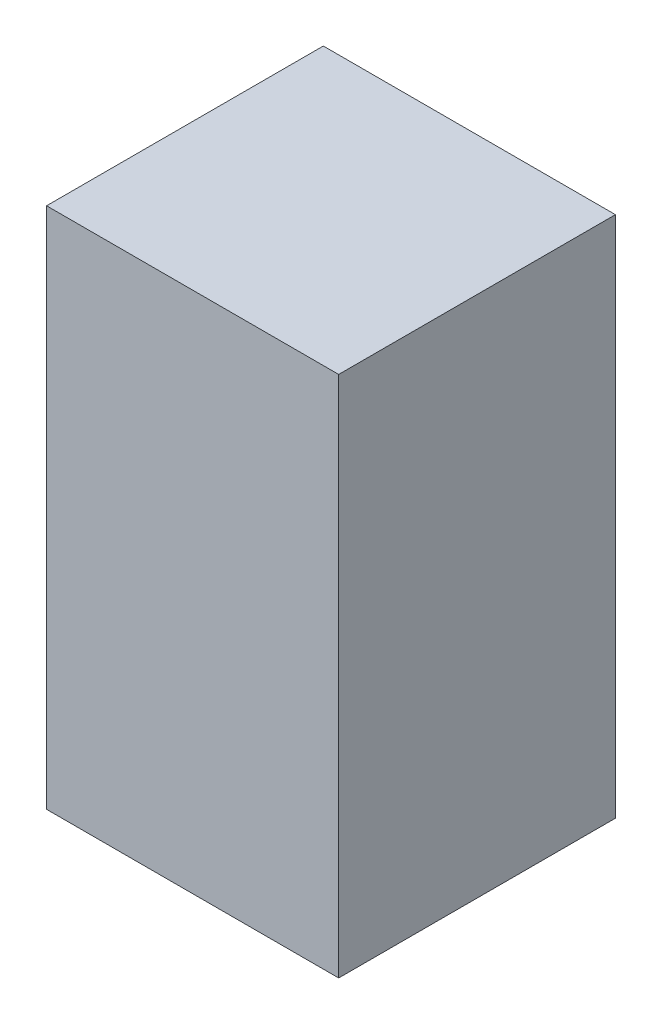
ISO-10303-21;
HEADER;
FILE_DESCRIPTION(('STEP AP214'),'2;1');
FILE_NAME('part.step','',(''),(''),'','','');
FILE_SCHEMA(('AUTOMOTIVE_DESIGN { 1 0 10303 214 1 1 1 1 }'));
ENDSEC;
DATA;
#1=APPLICATION_CONTEXT('core data for automotive mechanical design processes');
#2=APPLICATION_PROTOCOL_DEFINITION('international standard','automotive_design',2000,#1);
#3=PRODUCT_CONTEXT('',#1,'mechanical');
#4=PRODUCT('Part','Part','',(#3));
#5=PRODUCT_RELATED_PRODUCT_CATEGORY('part','',(#4));
#6=PRODUCT_DEFINITION_FORMATION('','',#4);
#7=PRODUCT_DEFINITION_CONTEXT('part definition',#1,'design');
#8=PRODUCT_DEFINITION('design','',#6,#7);
#9=PRODUCT_DEFINITION_SHAPE('','',#8);
#10=(LENGTH_UNIT() NAMED_UNIT(*) SI_UNIT(.MILLI.,.METRE.));
#11=(NAMED_UNIT(*) PLANE_ANGLE_UNIT() SI_UNIT($,.RADIAN.));
#12=(NAMED_UNIT(*) SI_UNIT($,.STERADIAN.) SOLID_ANGLE_UNIT());
#13=UNCERTAINTY_MEASURE_WITH_UNIT(LENGTH_MEASURE(1.E-05),#10,'distance_accuracy_value','');
#14=(GEOMETRIC_REPRESENTATION_CONTEXT(3) GLOBAL_UNCERTAINTY_ASSIGNED_CONTEXT((#13)) GLOBAL_UNIT_ASSIGNED_CONTEXT((#10,
#11,#12)) REPRESENTATION_CONTEXT('',''));
#15=CARTESIAN_POINT('',(0.,0.,0.));
#16=DIRECTION('',(0.,0.,1.));
#17=DIRECTION('',(1.,0.,0.));
#18=AXIS2_PLACEMENT_3D('',#15,#16,#17);
#19=CARTESIAN_POINT('',(0.47500032,0.85000084,0.90000074));
#20=DIRECTION('',(1.,0.,0.));
#21=DIRECTION('',(0.,0.,-1.));
#22=AXIS2_PLACEMENT_3D('',#19,#20,#21);
#23=PLANE('',#22);
#24=DIRECTION('',(0.,-1.,0.));
#25=VECTOR('',#24,1.);
#26=CARTESIAN_POINT('',(0.47500032,0.85000084,0.));
#27=LINE('',#26,#25);
#28=CARTESIAN_POINT('',(0.47500032,0.85000084,0.));
#29=VERTEX_POINT('',#28);
#30=CARTESIAN_POINT('',(0.47500032,-0.85000084,0.));
#31=VERTEX_POINT('',#30);
#32=EDGE_CURVE('E96',#29,#31,#27,.T.);
#33=ORIENTED_EDGE('',*,*,#32,.F.);
#34=DIRECTION('',(0.,0.,-1.));
#35=VECTOR('',#34,1.);
#36=CARTESIAN_POINT('',(0.47500032,0.85000084,0.90000074));
#37=LINE('',#36,#35);
#38=CARTESIAN_POINT('',(0.47500032,0.85000084,0.90000074));
#39=VERTEX_POINT('',#38);
#40=EDGE_CURVE('E11',#39,#29,#37,.T.);
#41=ORIENTED_EDGE('',*,*,#40,.F.);
#42=DIRECTION('',(0.,-1.,0.));
#43=VECTOR('',#42,1.);
#44=CARTESIAN_POINT('',(0.47500032,0.85000084,0.90000074));
#45=LINE('',#44,#43);
#46=CARTESIAN_POINT('',(0.47500032,-0.85000084,0.90000074));
#47=VERTEX_POINT('',#46);
#48=EDGE_CURVE('E90',#39,#47,#45,.T.);
#49=ORIENTED_EDGE('',*,*,#48,.T.);
#50=DIRECTION('',(0.,0.,-1.));
#51=VECTOR('',#50,1.);
#52=CARTESIAN_POINT('',(0.47500032,-0.85000084,0.90000074));
#53=LINE('',#52,#51);
#54=EDGE_CURVE('E35',#47,#31,#53,.T.);
#55=ORIENTED_EDGE('',*,*,#54,.T.);
#56=EDGE_LOOP('',(#33,#41,#49,#55));
#57=FACE_BOUND('',#56,.T.);
#58=ADVANCED_FACE('F32',(#57),#23,.T.);
#59=CARTESIAN_POINT('',(-0.47500032,0.85000084,0.90000074));
#60=DIRECTION('',(0.,1.,0.));
#61=DIRECTION('',(0.,0.,1.));
#62=AXIS2_PLACEMENT_3D('',#59,#60,#61);
#63=PLANE('',#62);
#64=DIRECTION('',(1.,0.,0.));
#65=VECTOR('',#64,1.);
#66=CARTESIAN_POINT('',(-0.47500032,0.85000084,0.));
#67=LINE('',#66,#65);
#68=CARTESIAN_POINT('',(-0.47500032,0.85000084,0.));
#69=VERTEX_POINT('',#68);
#70=EDGE_CURVE('E92',#69,#29,#67,.T.);
#71=ORIENTED_EDGE('',*,*,#70,.F.);
#72=DIRECTION('',(0.,0.,-1.));
#73=VECTOR('',#72,1.);
#74=CARTESIAN_POINT('',(-0.47500032,0.85000084,0.90000074));
#75=LINE('',#74,#73);
#76=CARTESIAN_POINT('',(-0.47500032,0.85000084,0.90000074));
#77=VERTEX_POINT('',#76);
#78=EDGE_CURVE('E41',#77,#69,#75,.T.);
#79=ORIENTED_EDGE('',*,*,#78,.F.);
#80=DIRECTION('',(1.,0.,0.));
#81=VECTOR('',#80,1.);
#82=CARTESIAN_POINT('',(-0.47500032,0.85000084,0.90000074));
#83=LINE('',#82,#81);
#84=EDGE_CURVE('E87',#77,#39,#83,.T.);
#85=ORIENTED_EDGE('',*,*,#84,.T.);
#86=ORIENTED_EDGE('',*,*,#40,.T.);
#87=EDGE_LOOP('',(#71,#79,#85,#86));
#88=FACE_BOUND('',#87,.T.);
#89=ADVANCED_FACE('F106',(#88),#63,.T.);
#90=CARTESIAN_POINT('',(-0.47500032,-0.85000084,0.90000074));
#91=DIRECTION('',(-1.,0.,0.));
#92=DIRECTION('',(0.,0.,1.));
#93=AXIS2_PLACEMENT_3D('',#90,#91,#92);
#94=PLANE('',#93);
#95=DIRECTION('',(0.,1.,0.));
#96=VECTOR('',#95,1.);
#97=CARTESIAN_POINT('',(-0.47500032,-0.85000084,0.));
#98=LINE('',#97,#96);
#99=CARTESIAN_POINT('',(-0.47500032,-0.85000084,0.));
#100=VERTEX_POINT('',#99);
#101=EDGE_CURVE('E82',#100,#69,#98,.T.);
#102=ORIENTED_EDGE('',*,*,#101,.F.);
#103=DIRECTION('',(0.,0.,-1.));
#104=VECTOR('',#103,1.);
#105=CARTESIAN_POINT('',(-0.47500032,-0.85000084,0.90000074));
#106=LINE('',#105,#104);
#107=CARTESIAN_POINT('',(-0.47500032,-0.85000084,0.90000074));
#108=VERTEX_POINT('',#107);
#109=EDGE_CURVE('E77',#108,#100,#106,.T.);
#110=ORIENTED_EDGE('',*,*,#109,.F.);
#111=DIRECTION('',(0.,1.,0.));
#112=VECTOR('',#111,1.);
#113=CARTESIAN_POINT('',(-0.47500032,-0.85000084,0.90000074));
#114=LINE('',#113,#112);
#115=EDGE_CURVE('E80',#108,#77,#114,.T.);
#116=ORIENTED_EDGE('',*,*,#115,.T.);
#117=ORIENTED_EDGE('',*,*,#78,.T.);
#118=EDGE_LOOP('',(#102,#110,#116,#117));
#119=FACE_BOUND('',#118,.T.);
#120=ADVANCED_FACE('F79',(#119),#94,.T.);
#121=CARTESIAN_POINT('',(0.47500032,-0.85000084,0.90000074));
#122=DIRECTION('',(0.,-1.,0.));
#123=DIRECTION('',(0.,0.,-1.));
#124=AXIS2_PLACEMENT_3D('',#121,#122,#123);
#125=PLANE('',#124);
#126=DIRECTION('',(-1.,0.,0.));
#127=VECTOR('',#126,1.);
#128=CARTESIAN_POINT('',(0.47500032,-0.85000084,0.));
#129=LINE('',#128,#127);
#130=EDGE_CURVE('E99',#31,#100,#129,.T.);
#131=ORIENTED_EDGE('',*,*,#130,.F.);
#132=ORIENTED_EDGE('',*,*,#54,.F.);
#133=DIRECTION('',(-1.,0.,0.));
#134=VECTOR('',#133,1.);
#135=CARTESIAN_POINT('',(0.47500032,-0.85000084,0.90000074));
#136=LINE('',#135,#134);
#137=EDGE_CURVE('E86',#47,#108,#136,.T.);
#138=ORIENTED_EDGE('',*,*,#137,.T.);
#139=ORIENTED_EDGE('',*,*,#109,.T.);
#140=EDGE_LOOP('',(#131,#132,#138,#139));
#141=FACE_BOUND('',#140,.T.);
#142=ADVANCED_FACE('F89',(#141),#125,.T.);
#143=CARTESIAN_POINT('',(0.,0.,0.90000074));
#144=DIRECTION('',(0.,0.,-1.));
#145=DIRECTION('',(-1.,0.,0.));
#146=AXIS2_PLACEMENT_3D('',#143,#144,#145);
#147=PLANE('',#146);
#148=ORIENTED_EDGE('',*,*,#48,.F.);
#149=ORIENTED_EDGE('',*,*,#84,.F.);
#150=ORIENTED_EDGE('',*,*,#115,.F.);
#151=ORIENTED_EDGE('',*,*,#137,.F.);
#152=EDGE_LOOP('',(#148,#149,#150,#151));
#153=FACE_BOUND('',#152,.T.);
#154=ADVANCED_FACE('F85',(#153),#147,.F.);
#155=CARTESIAN_POINT('',(0.,0.,0.));
#156=DIRECTION('',(0.,0.,-1.));
#157=DIRECTION('',(-1.,0.,0.));
#158=AXIS2_PLACEMENT_3D('',#155,#156,#157);
#159=PLANE('',#158);
#160=ORIENTED_EDGE('',*,*,#32,.T.);
#161=ORIENTED_EDGE('',*,*,#130,.T.);
#162=ORIENTED_EDGE('',*,*,#101,.T.);
#163=ORIENTED_EDGE('',*,*,#70,.T.);
#164=EDGE_LOOP('',(#160,#161,#162,#163));
#165=FACE_BOUND('',#164,.T.);
#166=ADVANCED_FACE('F105',(#165),#159,.T.);
#167=CLOSED_SHELL('',(#58,#89,#120,#142,#154,#166));
#168=MANIFOLD_SOLID_BREP('B2',#167);
#169=ADVANCED_BREP_SHAPE_REPRESENTATION('',(#18,#168),#14);
#170=SHAPE_DEFINITION_REPRESENTATION(#9,#169);
ENDSEC;
END-ISO-10303-21;
